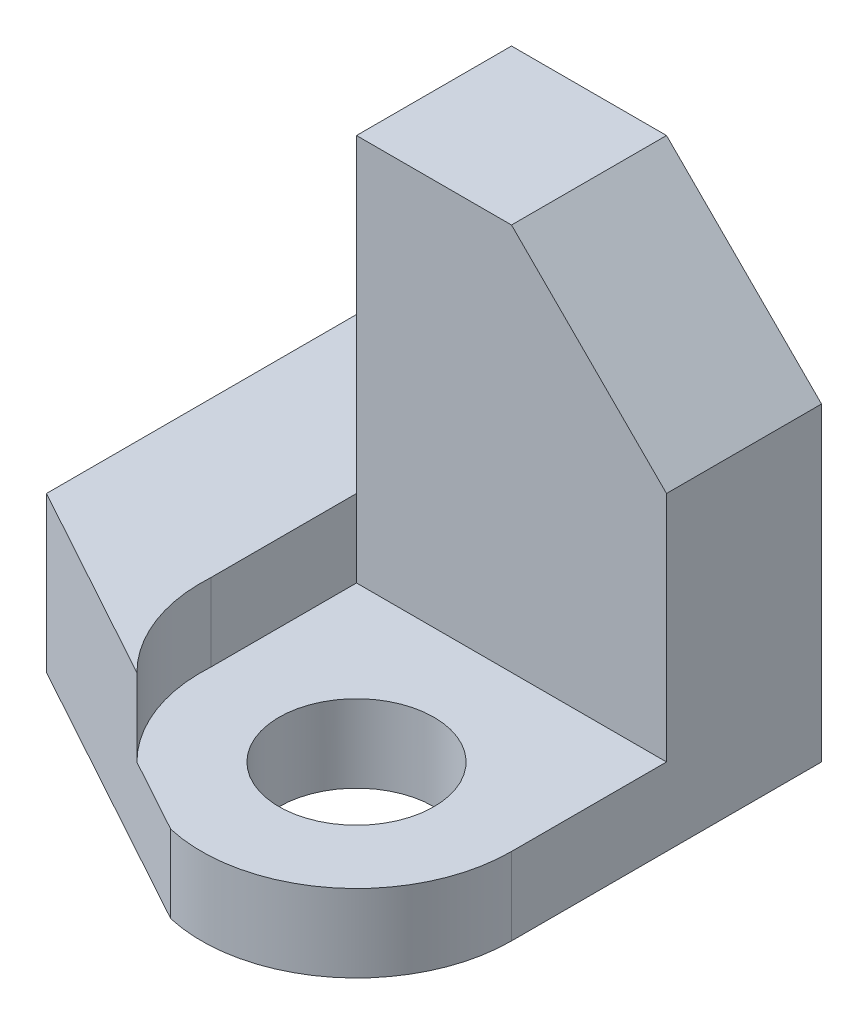
ISO-10303-21;
HEADER;
FILE_DESCRIPTION(('STEP AP214'),'2;1');
FILE_NAME('part.step','',(''),(''),'','','');
FILE_SCHEMA(('AUTOMOTIVE_DESIGN { 1 0 10303 214 1 1 1 1 }'));
ENDSEC;
DATA;
#1=APPLICATION_CONTEXT('core data for automotive mechanical design processes');
#2=APPLICATION_PROTOCOL_DEFINITION('international standard','automotive_design',2000,#1);
#3=PRODUCT_CONTEXT('',#1,'mechanical');
#4=PRODUCT('Part','Part','',(#3));
#5=PRODUCT_RELATED_PRODUCT_CATEGORY('part','',(#4));
#6=PRODUCT_DEFINITION_FORMATION('','',#4);
#7=PRODUCT_DEFINITION_CONTEXT('part definition',#1,'design');
#8=PRODUCT_DEFINITION('design','',#6,#7);
#9=PRODUCT_DEFINITION_SHAPE('','',#8);
#10=(LENGTH_UNIT() NAMED_UNIT(*) SI_UNIT(.MILLI.,.METRE.));
#11=(NAMED_UNIT(*) PLANE_ANGLE_UNIT() SI_UNIT($,.RADIAN.));
#12=(NAMED_UNIT(*) SI_UNIT($,.STERADIAN.) SOLID_ANGLE_UNIT());
#13=UNCERTAINTY_MEASURE_WITH_UNIT(LENGTH_MEASURE(1.E-05),#10,'distance_accuracy_value','');
#14=(GEOMETRIC_REPRESENTATION_CONTEXT(3) GLOBAL_UNCERTAINTY_ASSIGNED_CONTEXT((#13)) GLOBAL_UNIT_ASSIGNED_CONTEXT((#10,
#11,#12)) REPRESENTATION_CONTEXT('',''));
#15=CARTESIAN_POINT('',(0.,0.,0.));
#16=DIRECTION('',(0.,0.,1.));
#17=DIRECTION('',(1.,0.,0.));
#18=AXIS2_PLACEMENT_3D('',#15,#16,#17);
#19=CARTESIAN_POINT('',(1.99805378916452,1.,4.));
#20=DIRECTION('',(0.,-1.,0.));
#21=DIRECTION('',(0.,0.,-1.));
#22=AXIS2_PLACEMENT_3D('',#19,#20,#21);
#23=PLANE('',#22);
#24=CARTESIAN_POINT('',(2.,1.,4.));
#25=DIRECTION('',(0.,-1.,0.));
#26=DIRECTION('',(0.,0.,-1.));
#27=AXIS2_PLACEMENT_3D('',#24,#25,#26);
#28=CIRCLE('',#27,1.);
#29=CARTESIAN_POINT('',(2.,1.,3.));
#30=VERTEX_POINT('',#29);
#31=EDGE_CURVE('E167',#30,#30,#28,.T.);
#32=ORIENTED_EDGE('',*,*,#31,.T.);
#33=EDGE_LOOP('',(#32));
#34=FACE_BOUND('',#33,.T.);
#35=DIRECTION('',(1.,0.,0.));
#36=VECTOR('',#35,1.);
#37=CARTESIAN_POINT('',(0.,1.,2.));
#38=LINE('',#37,#36);
#39=CARTESIAN_POINT('',(0.,1.,2.));
#40=VERTEX_POINT('',#39);
#41=CARTESIAN_POINT('',(4.,1.,2.));
#42=VERTEX_POINT('',#41);
#43=EDGE_CURVE('E137',#40,#42,#38,.T.);
#44=ORIENTED_EDGE('',*,*,#43,.F.);
#45=DIRECTION('',(0.,0.,1.));
#46=VECTOR('',#45,1.);
#47=CARTESIAN_POINT('',(0.,1.,3.87522144942403));
#48=LINE('',#47,#46);
#49=CARTESIAN_POINT('',(0.,1.,3.87522144942403));
#50=VERTEX_POINT('',#49);
#51=EDGE_CURVE('E151',#40,#50,#48,.T.);
#52=ORIENTED_EDGE('',*,*,#51,.T.);
#53=CARTESIAN_POINT('',(1.99805378916452,1.,4.));
#54=DIRECTION('',(0.,1.,0.));
#55=DIRECTION('',(0.,0.,-1.));
#56=AXIS2_PLACEMENT_3D('',#53,#54,#55);
#57=CIRCLE('',#56,2.00194621083548);
#58=CARTESIAN_POINT('',(0.585520601583238,1.,5.41863970939065));
#59=VERTEX_POINT('',#58);
#60=EDGE_CURVE('E153',#50,#59,#57,.T.);
#61=ORIENTED_EDGE('',*,*,#60,.T.);
#62=DIRECTION('',(-0.876701798036995,0.,-0.481034257947082));
#63=VECTOR('',#62,1.);
#64=CARTESIAN_POINT('',(-2.14968231007578,1.,3.91787136844438));
#65=LINE('',#64,#63);
#66=CARTESIAN_POINT('',(1.55276658925382,1.,5.94935432292653));
#67=VERTEX_POINT('',#66);
#68=EDGE_CURVE('E170',#67,#59,#65,.T.);
#69=ORIENTED_EDGE('',*,*,#68,.F.);
#70=CARTESIAN_POINT('',(2.,1.,4.));
#71=DIRECTION('',(0.,-1.,0.));
#72=DIRECTION('',(0.,0.,-1.));
#73=AXIS2_PLACEMENT_3D('',#70,#71,#72);
#74=CIRCLE('',#73,2.);
#75=CARTESIAN_POINT('',(4.,1.,4.));
#76=VERTEX_POINT('',#75);
#77=EDGE_CURVE('E168',#67,#76,#74,.F.);
#78=ORIENTED_EDGE('',*,*,#77,.T.);
#79=DIRECTION('',(0.,0.,-1.));
#80=VECTOR('',#79,1.);
#81=CARTESIAN_POINT('',(4.,1.,0.));
#82=LINE('',#81,#80);
#83=EDGE_CURVE('E157',#76,#42,#82,.T.);
#84=ORIENTED_EDGE('',*,*,#83,.T.);
#85=EDGE_LOOP('',(#44,#52,#61,#69,#78,#84));
#86=FACE_BOUND('',#85,.T.);
#87=ADVANCED_FACE('F35',(#34,#86),#23,.F.);
#88=CARTESIAN_POINT('',(0.,1.,3.87522144942403));
#89=DIRECTION('',(-1.,0.,0.));
#90=DIRECTION('',(0.,0.,1.));
#91=AXIS2_PLACEMENT_3D('',#88,#89,#90);
#92=PLANE('',#91);
#93=DIRECTION('',(0.,-1.,0.));
#94=VECTOR('',#93,1.);
#95=CARTESIAN_POINT('',(0.,1.,2.));
#96=LINE('',#95,#94);
#97=CARTESIAN_POINT('',(0.,2.,2.));
#98=VERTEX_POINT('',#97);
#99=EDGE_CURVE('E208',#98,#40,#96,.T.);
#100=ORIENTED_EDGE('',*,*,#99,.F.);
#101=DIRECTION('',(0.,0.,1.));
#102=VECTOR('',#101,1.);
#103=CARTESIAN_POINT('',(0.,2.,3.87522144942403));
#104=LINE('',#103,#102);
#105=CARTESIAN_POINT('',(0.,2.,3.87522144942403));
#106=VERTEX_POINT('',#105);
#107=EDGE_CURVE('E143',#98,#106,#104,.T.);
#108=ORIENTED_EDGE('',*,*,#107,.T.);
#109=DIRECTION('',(0.,1.,0.));
#110=VECTOR('',#109,1.);
#111=CARTESIAN_POINT('',(0.,1.,3.87522144942403));
#112=LINE('',#111,#110);
#113=EDGE_CURVE('E159',#50,#106,#112,.T.);
#114=ORIENTED_EDGE('',*,*,#113,.F.);
#115=ORIENTED_EDGE('',*,*,#51,.F.);
#116=EDGE_LOOP('',(#100,#108,#114,#115));
#117=FACE_BOUND('',#116,.T.);
#118=ADVANCED_FACE('F224',(#117),#92,.F.);
#119=CARTESIAN_POINT('',(-2.14968231007578,2.,3.91787136844438));
#120=DIRECTION('',(0.481034257947082,0.,-0.876701798036995));
#121=DIRECTION('',(-0.876701798036995,0.,-0.481034257947082));
#122=AXIS2_PLACEMENT_3D('',#119,#120,#121);
#123=PLANE('',#122);
#124=ORIENTED_EDGE('',*,*,#68,.T.);
#125=DIRECTION('',(0.,1.,0.));
#126=VECTOR('',#125,1.);
#127=CARTESIAN_POINT('',(0.585520601583238,1.,5.41863970939065));
#128=LINE('',#127,#126);
#129=CARTESIAN_POINT('',(0.585520601583238,2.,5.41863970939065));
#130=VERTEX_POINT('',#129);
#131=EDGE_CURVE('E164',#59,#130,#128,.T.);
#132=ORIENTED_EDGE('',*,*,#131,.T.);
#133=DIRECTION('',(0.876701798036995,0.,0.481034257947082));
#134=VECTOR('',#133,1.);
#135=CARTESIAN_POINT('',(-2.14968231007578,2.,3.91787136844438));
#136=LINE('',#135,#134);
#137=CARTESIAN_POINT('',(-2.,2.,3.99999999999998));
#138=VERTEX_POINT('',#137);
#139=EDGE_CURVE('E174',#138,#130,#136,.T.);
#140=ORIENTED_EDGE('',*,*,#139,.F.);
#141=DIRECTION('',(0.,-1.,0.));
#142=VECTOR('',#141,1.);
#143=CARTESIAN_POINT('',(-2.,2.,3.99999999999998));
#144=LINE('',#143,#142);
#145=CARTESIAN_POINT('',(-2.,0.,3.99999999999998));
#146=VERTEX_POINT('',#145);
#147=EDGE_CURVE('E182',#138,#146,#144,.T.);
#148=ORIENTED_EDGE('',*,*,#147,.T.);
#149=DIRECTION('',(0.876701798036995,0.,0.481034257947082));
#150=VECTOR('',#149,1.);
#151=CARTESIAN_POINT('',(-2.14968231007578,0.,3.91787136844438));
#152=LINE('',#151,#150);
#153=CARTESIAN_POINT('',(1.55276658925382,0.,5.94935432292653));
#154=VERTEX_POINT('',#153);
#155=EDGE_CURVE('E173',#146,#154,#152,.T.);
#156=ORIENTED_EDGE('',*,*,#155,.T.);
#157=DIRECTION('',(0.,-1.,0.));
#158=VECTOR('',#157,1.);
#159=CARTESIAN_POINT('',(1.55276658925382,2.,5.94935432292653));
#160=LINE('',#159,#158);
#161=EDGE_CURVE('E206',#67,#154,#160,.T.);
#162=ORIENTED_EDGE('',*,*,#161,.F.);
#163=EDGE_LOOP('',(#124,#132,#140,#148,#156,#162));
#164=FACE_BOUND('',#163,.T.);
#165=ADVANCED_FACE('F233',(#164),#123,.F.);
#166=CARTESIAN_POINT('',(2.,2.,4.));
#167=DIRECTION('',(0.,-1.,0.));
#168=DIRECTION('',(0.,0.,-1.));
#169=AXIS2_PLACEMENT_3D('',#166,#167,#168);
#170=CYLINDRICAL_SURFACE('',#169,2.);
#171=ORIENTED_EDGE('',*,*,#77,.F.);
#172=ORIENTED_EDGE('',*,*,#161,.T.);
#173=CARTESIAN_POINT('',(2.,0.,4.));
#174=DIRECTION('',(0.,1.,0.));
#175=DIRECTION('',(0.,0.,1.));
#176=AXIS2_PLACEMENT_3D('',#173,#174,#175);
#177=CIRCLE('',#176,2.);
#178=CARTESIAN_POINT('',(4.,0.,4.));
#179=VERTEX_POINT('',#178);
#180=EDGE_CURVE('E185',#179,#154,#177,.F.);
#181=ORIENTED_EDGE('',*,*,#180,.F.);
#182=DIRECTION('',(0.,-1.,0.));
#183=VECTOR('',#182,1.);
#184=CARTESIAN_POINT('',(4.,2.,4.));
#185=LINE('',#184,#183);
#186=EDGE_CURVE('E204',#76,#179,#185,.T.);
#187=ORIENTED_EDGE('',*,*,#186,.F.);
#188=EDGE_LOOP('',(#171,#172,#181,#187));
#189=FACE_BOUND('',#188,.T.);
#190=ADVANCED_FACE('F238',(#189),#170,.T.);
#191=CARTESIAN_POINT('',(4.,2.,0.));
#192=DIRECTION('',(1.,0.,0.));
#193=DIRECTION('',(0.,0.,-1.));
#194=AXIS2_PLACEMENT_3D('',#191,#192,#193);
#195=PLANE('',#194);
#196=DIRECTION('',(0.,-1.,0.));
#197=VECTOR('',#196,1.);
#198=CARTESIAN_POINT('',(4.,2.,0.));
#199=LINE('',#198,#197);
#200=CARTESIAN_POINT('',(4.,3.99999999999999,0.));
#201=VERTEX_POINT('',#200);
#202=CARTESIAN_POINT('',(4.,0.,0.));
#203=VERTEX_POINT('',#202);
#204=EDGE_CURVE('E202',#201,#203,#199,.T.);
#205=ORIENTED_EDGE('',*,*,#204,.F.);
#206=DIRECTION('',(0.,0.,1.));
#207=VECTOR('',#206,1.);
#208=CARTESIAN_POINT('',(4.,3.99999999999999,0.));
#209=LINE('',#208,#207);
#210=CARTESIAN_POINT('',(4.,3.99999999999999,2.));
#211=VERTEX_POINT('',#210);
#212=EDGE_CURVE('E43',#201,#211,#209,.T.);
#213=ORIENTED_EDGE('',*,*,#212,.T.);
#214=DIRECTION('',(0.,-1.,0.));
#215=VECTOR('',#214,1.);
#216=CARTESIAN_POINT('',(4.,6.,2.));
#217=LINE('',#216,#215);
#218=EDGE_CURVE('E144',#211,#42,#217,.T.);
#219=ORIENTED_EDGE('',*,*,#218,.T.);
#220=ORIENTED_EDGE('',*,*,#83,.F.);
#221=ORIENTED_EDGE('',*,*,#186,.T.);
#222=DIRECTION('',(0.,0.,1.));
#223=VECTOR('',#222,1.);
#224=CARTESIAN_POINT('',(4.,0.,0.));
#225=LINE('',#224,#223);
#226=EDGE_CURVE('E188',#203,#179,#225,.T.);
#227=ORIENTED_EDGE('',*,*,#226,.F.);
#228=EDGE_LOOP('',(#205,#213,#219,#220,#221,#227));
#229=FACE_BOUND('',#228,.T.);
#230=ADVANCED_FACE('F240',(#229),#195,.T.);
#231=CARTESIAN_POINT('',(0.,2.,0.));
#232=DIRECTION('',(0.,0.,1.));
#233=DIRECTION('',(1.,0.,0.));
#234=AXIS2_PLACEMENT_3D('',#231,#232,#233);
#235=PLANE('',#234);
#236=DIRECTION('',(-1.,0.,0.));
#237=VECTOR('',#236,1.);
#238=CARTESIAN_POINT('',(0.,6.,0.));
#239=LINE('',#238,#237);
#240=CARTESIAN_POINT('',(2.,6.,0.));
#241=VERTEX_POINT('',#240);
#242=CARTESIAN_POINT('',(0.,6.,0.));
#243=VERTEX_POINT('',#242);
#244=EDGE_CURVE('E129',#241,#243,#239,.T.);
#245=ORIENTED_EDGE('',*,*,#244,.F.);
#246=DIRECTION('',(-0.707106781186546,0.707106781186549,0.));
#247=VECTOR('',#246,1.);
#248=CARTESIAN_POINT('',(2.,6.,0.));
#249=LINE('',#248,#247);
#250=EDGE_CURVE('E57',#241,#201,#249,.F.);
#251=ORIENTED_EDGE('',*,*,#250,.T.);
#252=ORIENTED_EDGE('',*,*,#204,.T.);
#253=DIRECTION('',(-1.,0.,0.));
#254=VECTOR('',#253,1.);
#255=CARTESIAN_POINT('',(0.,0.,0.));
#256=LINE('',#255,#254);
#257=CARTESIAN_POINT('',(-2.,0.,0.));
#258=VERTEX_POINT('',#257);
#259=EDGE_CURVE('E191',#203,#258,#256,.T.);
#260=ORIENTED_EDGE('',*,*,#259,.T.);
#261=DIRECTION('',(0.,-1.,0.));
#262=VECTOR('',#261,1.);
#263=CARTESIAN_POINT('',(-2.,2.,0.));
#264=LINE('',#263,#262);
#265=CARTESIAN_POINT('',(-2.,2.,0.));
#266=VERTEX_POINT('',#265);
#267=EDGE_CURVE('E199',#266,#258,#264,.T.);
#268=ORIENTED_EDGE('',*,*,#267,.F.);
#269=DIRECTION('',(-1.,0.,0.));
#270=VECTOR('',#269,1.);
#271=CARTESIAN_POINT('',(0.,2.,0.));
#272=LINE('',#271,#270);
#273=CARTESIAN_POINT('',(0.,2.,0.));
#274=VERTEX_POINT('',#273);
#275=EDGE_CURVE('E177',#274,#266,#272,.T.);
#276=ORIENTED_EDGE('',*,*,#275,.F.);
#277=DIRECTION('',(0.,-1.,0.));
#278=VECTOR('',#277,1.);
#279=CARTESIAN_POINT('',(0.,6.,0.));
#280=LINE('',#279,#278);
#281=EDGE_CURVE('E147',#243,#274,#280,.T.);
#282=ORIENTED_EDGE('',*,*,#281,.F.);
#283=EDGE_LOOP('',(#245,#251,#252,#260,#268,#276,#282));
#284=FACE_BOUND('',#283,.T.);
#285=ADVANCED_FACE('F215',(#284),#235,.F.);
#286=CARTESIAN_POINT('',(-2.,2.,0.));
#287=DIRECTION('',(1.,0.,0.));
#288=DIRECTION('',(0.,0.,-1.));
#289=AXIS2_PLACEMENT_3D('',#286,#287,#288);
#290=PLANE('',#289);
#291=DIRECTION('',(0.,0.,1.));
#292=VECTOR('',#291,1.);
#293=CARTESIAN_POINT('',(-2.,0.,0.));
#294=LINE('',#293,#292);
#295=EDGE_CURVE('E193',#258,#146,#294,.T.);
#296=ORIENTED_EDGE('',*,*,#295,.T.);
#297=ORIENTED_EDGE('',*,*,#147,.F.);
#298=DIRECTION('',(0.,0.,1.));
#299=VECTOR('',#298,1.);
#300=CARTESIAN_POINT('',(-2.,2.,0.));
#301=LINE('',#300,#299);
#302=EDGE_CURVE('E180',#266,#138,#301,.T.);
#303=ORIENTED_EDGE('',*,*,#302,.F.);
#304=ORIENTED_EDGE('',*,*,#267,.T.);
#305=EDGE_LOOP('',(#296,#297,#303,#304));
#306=FACE_BOUND('',#305,.T.);
#307=ADVANCED_FACE('F250',(#306),#290,.F.);
#308=CARTESIAN_POINT('',(2.,2.,4.));
#309=DIRECTION('',(0.,-1.,0.));
#310=DIRECTION('',(0.,0.,-1.));
#311=AXIS2_PLACEMENT_3D('',#308,#309,#310);
#312=CYLINDRICAL_SURFACE('',#311,1.);
#313=ORIENTED_EDGE('',*,*,#31,.F.);
#314=EDGE_LOOP('',(#313));
#315=FACE_BOUND('',#314,.T.);
#316=CARTESIAN_POINT('',(2.,0.,4.));
#317=DIRECTION('',(0.,1.,0.));
#318=DIRECTION('',(0.,0.,1.));
#319=AXIS2_PLACEMENT_3D('',#316,#317,#318);
#320=CIRCLE('',#319,1.);
#321=CARTESIAN_POINT('',(2.,0.,5.));
#322=VERTEX_POINT('',#321);
#323=EDGE_CURVE('E178',#322,#322,#320,.T.);
#324=ORIENTED_EDGE('',*,*,#323,.F.);
#325=EDGE_LOOP('',(#324));
#326=FACE_BOUND('',#325,.T.);
#327=ADVANCED_FACE('F255',(#315,#326),#312,.F.);
#328=CARTESIAN_POINT('',(0.,2.,0.));
#329=DIRECTION('',(0.,1.,0.));
#330=DIRECTION('',(0.,0.,1.));
#331=AXIS2_PLACEMENT_3D('',#328,#329,#330);
#332=PLANE('',#331);
#333=EDGE_CURVE('E142',#274,#98,#104,.T.);
#334=ORIENTED_EDGE('',*,*,#333,.F.);
#335=ORIENTED_EDGE('',*,*,#275,.T.);
#336=ORIENTED_EDGE('',*,*,#302,.T.);
#337=ORIENTED_EDGE('',*,*,#139,.T.);
#338=CARTESIAN_POINT('',(1.99805378916452,2.,4.));
#339=DIRECTION('',(0.,1.,0.));
#340=DIRECTION('',(0.,0.,-1.));
#341=AXIS2_PLACEMENT_3D('',#338,#339,#340);
#342=CIRCLE('',#341,2.00194621083548);
#343=EDGE_CURVE('E154',#106,#130,#342,.T.);
#344=ORIENTED_EDGE('',*,*,#343,.F.);
#345=ORIENTED_EDGE('',*,*,#107,.F.);
#346=EDGE_LOOP('',(#334,#335,#336,#337,#344,#345));
#347=FACE_BOUND('',#346,.T.);
#348=ADVANCED_FACE('F253',(#347),#332,.T.);
#349=CARTESIAN_POINT('',(0.,0.,0.));
#350=DIRECTION('',(0.,1.,0.));
#351=DIRECTION('',(0.,0.,1.));
#352=AXIS2_PLACEMENT_3D('',#349,#350,#351);
#353=PLANE('',#352);
#354=ORIENTED_EDGE('',*,*,#155,.F.);
#355=ORIENTED_EDGE('',*,*,#295,.F.);
#356=ORIENTED_EDGE('',*,*,#259,.F.);
#357=ORIENTED_EDGE('',*,*,#226,.T.);
#358=ORIENTED_EDGE('',*,*,#180,.T.);
#359=EDGE_LOOP('',(#354,#355,#356,#357,#358));
#360=FACE_BOUND('',#359,.T.);
#361=ORIENTED_EDGE('',*,*,#323,.T.);
#362=EDGE_LOOP('',(#361));
#363=FACE_BOUND('',#362,.T.);
#364=ADVANCED_FACE('F244',(#360,#363),#353,.F.);
#365=CARTESIAN_POINT('',(1.99805378916452,1.,4.));
#366=DIRECTION('',(0.,1.,0.));
#367=DIRECTION('',(0.,0.,1.));
#368=AXIS2_PLACEMENT_3D('',#365,#366,#367);
#369=CYLINDRICAL_SURFACE('',#368,2.00194621083548);
#370=ORIENTED_EDGE('',*,*,#60,.F.);
#371=ORIENTED_EDGE('',*,*,#113,.T.);
#372=ORIENTED_EDGE('',*,*,#343,.T.);
#373=ORIENTED_EDGE('',*,*,#131,.F.);
#374=EDGE_LOOP('',(#370,#371,#372,#373));
#375=FACE_BOUND('',#374,.T.);
#376=ADVANCED_FACE('F229',(#375),#369,.F.);
#377=CARTESIAN_POINT('',(0.,6.,0.));
#378=DIRECTION('',(1.,0.,0.));
#379=DIRECTION('',(0.,0.,-1.));
#380=AXIS2_PLACEMENT_3D('',#377,#378,#379);
#381=PLANE('',#380);
#382=ORIENTED_EDGE('',*,*,#333,.T.);
#383=DIRECTION('',(0.,-1.,0.));
#384=VECTOR('',#383,1.);
#385=CARTESIAN_POINT('',(0.,6.,2.));
#386=LINE('',#385,#384);
#387=CARTESIAN_POINT('',(0.,6.,2.));
#388=VERTEX_POINT('',#387);
#389=EDGE_CURVE('E124',#388,#98,#386,.T.);
#390=ORIENTED_EDGE('',*,*,#389,.F.);
#391=DIRECTION('',(0.,0.,1.));
#392=VECTOR('',#391,1.);
#393=CARTESIAN_POINT('',(0.,6.,0.));
#394=LINE('',#393,#392);
#395=EDGE_CURVE('E130',#243,#388,#394,.T.);
#396=ORIENTED_EDGE('',*,*,#395,.F.);
#397=ORIENTED_EDGE('',*,*,#281,.T.);
#398=EDGE_LOOP('',(#382,#390,#396,#397));
#399=FACE_BOUND('',#398,.T.);
#400=ADVANCED_FACE('F140',(#399),#381,.F.);
#401=CARTESIAN_POINT('',(0.,6.,2.));
#402=DIRECTION('',(0.,0.,-1.));
#403=DIRECTION('',(-1.,0.,0.));
#404=AXIS2_PLACEMENT_3D('',#401,#402,#403);
#405=PLANE('',#404);
#406=ORIENTED_EDGE('',*,*,#218,.F.);
#407=DIRECTION('',(0.707106781186546,-0.707106781186549,0.));
#408=VECTOR('',#407,1.);
#409=CARTESIAN_POINT('',(2.,6.,2.));
#410=LINE('',#409,#408);
#411=CARTESIAN_POINT('',(2.,6.,2.));
#412=VERTEX_POINT('',#411);
#413=EDGE_CURVE('E11',#211,#412,#410,.F.);
#414=ORIENTED_EDGE('',*,*,#413,.T.);
#415=DIRECTION('',(1.,0.,0.));
#416=VECTOR('',#415,1.);
#417=CARTESIAN_POINT('',(0.,6.,2.));
#418=LINE('',#417,#416);
#419=EDGE_CURVE('E119',#388,#412,#418,.T.);
#420=ORIENTED_EDGE('',*,*,#419,.F.);
#421=ORIENTED_EDGE('',*,*,#389,.T.);
#422=ORIENTED_EDGE('',*,*,#99,.T.);
#423=ORIENTED_EDGE('',*,*,#43,.T.);
#424=EDGE_LOOP('',(#406,#414,#420,#421,#422,#423));
#425=FACE_BOUND('',#424,.T.);
#426=ADVANCED_FACE('F121',(#425),#405,.F.);
#427=CARTESIAN_POINT('',(0.,6.,0.));
#428=DIRECTION('',(0.,1.,0.));
#429=DIRECTION('',(0.,0.,1.));
#430=AXIS2_PLACEMENT_3D('',#427,#428,#429);
#431=PLANE('',#430);
#432=ORIENTED_EDGE('',*,*,#419,.T.);
#433=DIRECTION('',(0.,0.,-1.));
#434=VECTOR('',#433,1.);
#435=CARTESIAN_POINT('',(2.,6.,0.));
#436=LINE('',#435,#434);
#437=EDGE_CURVE('E212',#412,#241,#436,.T.);
#438=ORIENTED_EDGE('',*,*,#437,.T.);
#439=ORIENTED_EDGE('',*,*,#244,.T.);
#440=ORIENTED_EDGE('',*,*,#395,.T.);
#441=EDGE_LOOP('',(#432,#438,#439,#440));
#442=FACE_BOUND('',#441,.T.);
#443=ADVANCED_FACE('F133',(#442),#431,.T.);
#444=CARTESIAN_POINT('',(2.,6.,0.));
#445=DIRECTION('',(-0.707106781186549,-0.707106781186546,0.));
#446=DIRECTION('',(0.,0.,-1.));
#447=AXIS2_PLACEMENT_3D('',#444,#445,#446);
#448=PLANE('',#447);
#449=ORIENTED_EDGE('',*,*,#413,.F.);
#450=ORIENTED_EDGE('',*,*,#212,.F.);
#451=ORIENTED_EDGE('',*,*,#250,.F.);
#452=ORIENTED_EDGE('',*,*,#437,.F.);
#453=EDGE_LOOP('',(#449,#450,#451,#452));
#454=FACE_BOUND('',#453,.T.);
#455=ADVANCED_FACE('F37',(#454),#448,.F.);
#456=CLOSED_SHELL('',(#87,#118,#165,#190,#230,#285,#307,#327,#348,#364,#376,#400,#426,#443,#455));
#457=MANIFOLD_SOLID_BREP('B2',#456);
#458=ADVANCED_BREP_SHAPE_REPRESENTATION('',(#18,#457),#14);
#459=SHAPE_DEFINITION_REPRESENTATION(#9,#458);
ENDSEC;
END-ISO-10303-21;
